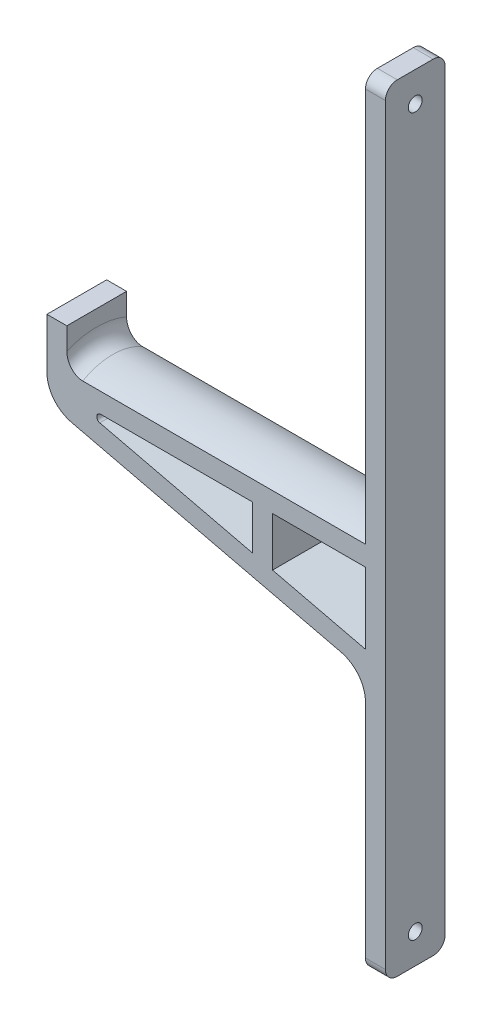
ISO-10303-21;
HEADER;
FILE_DESCRIPTION(('STEP AP214'),'2;1');
FILE_NAME('part.step','',(''),(''),'','','');
FILE_SCHEMA(('AUTOMOTIVE_DESIGN { 1 0 10303 214 1 1 1 1 }'));
ENDSEC;
DATA;
#1=APPLICATION_CONTEXT('core data for automotive mechanical design processes');
#2=APPLICATION_PROTOCOL_DEFINITION('international standard','automotive_design',2000,#1);
#3=PRODUCT_CONTEXT('',#1,'mechanical');
#4=PRODUCT('Part','Part','',(#3));
#5=PRODUCT_RELATED_PRODUCT_CATEGORY('part','',(#4));
#6=PRODUCT_DEFINITION_FORMATION('','',#4);
#7=PRODUCT_DEFINITION_CONTEXT('part definition',#1,'design');
#8=PRODUCT_DEFINITION('design','',#6,#7);
#9=PRODUCT_DEFINITION_SHAPE('','',#8);
#10=(LENGTH_UNIT() NAMED_UNIT(*) SI_UNIT(.MILLI.,.METRE.));
#11=(NAMED_UNIT(*) PLANE_ANGLE_UNIT() SI_UNIT($,.RADIAN.));
#12=(NAMED_UNIT(*) SI_UNIT($,.STERADIAN.) SOLID_ANGLE_UNIT());
#13=UNCERTAINTY_MEASURE_WITH_UNIT(LENGTH_MEASURE(1.E-05),#10,'distance_accuracy_value','');
#14=(GEOMETRIC_REPRESENTATION_CONTEXT(3) GLOBAL_UNCERTAINTY_ASSIGNED_CONTEXT((#13)) GLOBAL_UNIT_ASSIGNED_CONTEXT((#10,
#11,#12)) REPRESENTATION_CONTEXT('',''));
#15=CARTESIAN_POINT('',(0.,0.,0.));
#16=DIRECTION('',(0.,0.,1.));
#17=DIRECTION('',(1.,0.,0.));
#18=AXIS2_PLACEMENT_3D('',#15,#16,#17);
#19=CARTESIAN_POINT('',(0.,0.,-7.5));
#20=DIRECTION('',(0.,0.,-1.));
#21=DIRECTION('',(-1.,0.,0.));
#22=AXIS2_PLACEMENT_3D('',#19,#20,#21);
#23=PLANE('',#22);
#24=DIRECTION('',(0.972797328211724,-0.231657847318262,0.));
#25=VECTOR('',#24,1.);
#26=CARTESIAN_POINT('',(-25.8333333333333,-21.8036817957886,-7.5));
#27=LINE('',#26,#25);
#28=CARTESIAN_POINT('',(-25.8333333333333,-21.8036817957886,-7.5));
#29=VERTEX_POINT('',#28);
#30=CARTESIAN_POINT('',(-2.49999999999999,-27.3601832519512,-7.5));
#31=VERTEX_POINT('',#30);
#32=EDGE_CURVE('E266',#29,#31,#27,.T.);
#33=ORIENTED_EDGE('',*,*,#32,.T.);
#34=DIRECTION('',(0.,1.,0.));
#35=VECTOR('',#34,1.);
#36=CARTESIAN_POINT('',(-2.49999999999999,-9.50000000000023,-7.5));
#37=LINE('',#36,#35);
#38=CARTESIAN_POINT('',(-2.49999999999999,-9.50000000000023,-7.5));
#39=VERTEX_POINT('',#38);
#40=EDGE_CURVE('E262',#31,#39,#37,.T.);
#41=ORIENTED_EDGE('',*,*,#40,.T.);
#42=DIRECTION('',(-1.,0.,0.));
#43=VECTOR('',#42,1.);
#44=CARTESIAN_POINT('',(-2.49999999999999,-9.50000000000023,-7.5));
#45=LINE('',#44,#43);
#46=CARTESIAN_POINT('',(-25.8333333333333,-9.50000000000023,-7.5));
#47=VERTEX_POINT('',#46);
#48=EDGE_CURVE('E276',#39,#47,#45,.T.);
#49=ORIENTED_EDGE('',*,*,#48,.T.);
#50=DIRECTION('',(0.,-1.,0.));
#51=VECTOR('',#50,1.);
#52=CARTESIAN_POINT('',(-25.8333333333333,-9.50000000000023,-7.5));
#53=LINE('',#52,#51);
#54=EDGE_CURVE('E279',#47,#29,#53,.T.);
#55=ORIENTED_EDGE('',*,*,#54,.T.);
#56=EDGE_LOOP('',(#33,#41,#49,#55));
#57=FACE_BOUND('',#56,.T.);
#58=DIRECTION('',(0.,1.,0.));
#59=VECTOR('',#58,1.);
#60=CARTESIAN_POINT('',(-30.8333333333333,-9.50000000000023,-7.5));
#61=LINE('',#60,#59);
#62=CARTESIAN_POINT('',(-30.8333333333333,-20.6130029123253,-7.5));
#63=VERTEX_POINT('',#62);
#64=CARTESIAN_POINT('',(-30.8333333333333,-9.50000000000023,-7.5));
#65=VERTEX_POINT('',#64);
#66=EDGE_CURVE('E245',#63,#65,#61,.T.);
#67=ORIENTED_EDGE('',*,*,#66,.T.);
#68=DIRECTION('',(-1.,0.,0.));
#69=VECTOR('',#68,1.);
#70=CARTESIAN_POINT('',(-30.8333333333333,-9.50000000000023,-7.5));
#71=LINE('',#70,#69);
#72=CARTESIAN_POINT('',(-68.9840038831,-9.50000000000023,-7.5));
#73=VERTEX_POINT('',#72);
#74=EDGE_CURVE('E250',#65,#73,#71,.T.);
#75=ORIENTED_EDGE('',*,*,#74,.T.);
#76=CARTESIAN_POINT('',(-68.9840038831,-10.5000000000002,-7.5));
#77=DIRECTION('',(0.,0.,-1.));
#78=DIRECTION('',(-1.,0.,0.));
#79=AXIS2_PLACEMENT_3D('',#76,#77,#78);
#80=CIRCLE('',#79,1.);
#81=CARTESIAN_POINT('',(-69.2156617304183,-11.472797328212,-7.5));
#82=VERTEX_POINT('',#81);
#83=EDGE_CURVE('E348',#73,#82,#80,.F.);
#84=ORIENTED_EDGE('',*,*,#83,.T.);
#85=DIRECTION('',(0.972797328211724,-0.231657847318262,0.));
#86=VECTOR('',#85,1.);
#87=CARTESIAN_POINT('',(-77.5,-9.50000000000023,-7.5));
#88=LINE('',#87,#86);
#89=EDGE_CURVE('E253',#82,#63,#88,.T.);
#90=ORIENTED_EDGE('',*,*,#89,.T.);
#91=EDGE_LOOP('',(#67,#75,#84,#90));
#92=FACE_BOUND('',#91,.T.);
#93=DIRECTION('',(0.972797328211724,-0.231657847318262,0.));
#94=VECTOR('',#93,1.);
#95=CARTESIAN_POINT('',(-82.5,-13.4491378645859,-7.5));
#96=LINE('',#95,#94);
#97=CARTESIAN_POINT('',(-76.3532627785461,-14.9128959069426,-7.5));
#98=VERTEX_POINT('',#97);
#99=CARTESIAN_POINT('',(-8.64673722145387,-31.0362419576435,-7.5));
#100=VERTEX_POINT('',#99);
#101=EDGE_CURVE('E297',#98,#100,#96,.T.);
#102=ORIENTED_EDGE('',*,*,#101,.F.);
#103=CARTESIAN_POINT('',(-74.5,-7.13051728124883,-7.5));
#104=DIRECTION('',(0.,0.,-1.));
#105=DIRECTION('',(-1.,0.,0.));
#106=AXIS2_PLACEMENT_3D('',#103,#104,#105);
#107=CIRCLE('',#106,8.);
#108=CARTESIAN_POINT('',(-82.5,-7.13051728124883,-7.5));
#109=VERTEX_POINT('',#108);
#110=EDGE_CURVE('E397',#98,#109,#107,.T.);
#111=ORIENTED_EDGE('',*,*,#110,.T.);
#112=DIRECTION('',(0.,-1.,0.));
#113=VECTOR('',#112,1.);
#114=CARTESIAN_POINT('',(-82.5,-2.50000000000023,-7.5));
#115=LINE('',#114,#113);
#116=CARTESIAN_POINT('',(-82.5,5.49999999999977,-7.5));
#117=VERTEX_POINT('',#116);
#118=EDGE_CURVE('E320',#117,#109,#115,.T.);
#119=ORIENTED_EDGE('',*,*,#118,.F.);
#120=DIRECTION('',(-1.,0.,0.));
#121=VECTOR('',#120,1.);
#122=CARTESIAN_POINT('',(-82.5,5.49999999999977,-7.5));
#123=LINE('',#122,#121);
#124=CARTESIAN_POINT('',(-77.5,5.49999999999977,-7.5));
#125=VERTEX_POINT('',#124);
#126=EDGE_CURVE('E317',#125,#117,#123,.T.);
#127=ORIENTED_EDGE('',*,*,#126,.F.);
#128=DIRECTION('',(0.,1.,0.));
#129=VECTOR('',#128,1.);
#130=CARTESIAN_POINT('',(-77.5,5.49999999999977,-7.5));
#131=LINE('',#130,#129);
#132=CARTESIAN_POINT('',(-77.5,-0.0429097499041395,-7.5));
#133=VERTEX_POINT('',#132);
#134=EDGE_CURVE('E214',#133,#125,#131,.T.);
#135=ORIENTED_EDGE('',*,*,#134,.F.);
#136=CARTESIAN_POINT('',(-77.5,-0.0429097499041395,-7.5));
#137=CARTESIAN_POINT('',(-77.4999943278296,-0.177576007741638,-7.5));
#138=CARTESIAN_POINT('',(-77.4942567579362,-0.312170617133637,-7.5));
#139=CARTESIAN_POINT('',(-77.4714571774881,-0.580387440129107,-7.5));
#140=CARTESIAN_POINT('',(-77.4543960671081,-0.714009730174388,-7.5));
#141=CARTESIAN_POINT('',(-77.3864383600186,-1.11218740637753,-7.5));
#142=CARTESIAN_POINT('',(-77.3187673456991,-1.37407357490827,-7.5));
#143=CARTESIAN_POINT('',(-77.1405101950438,-1.88279924682887,-7.5));
#144=CARTESIAN_POINT('',(-77.0299099806489,-2.12963378347929,-7.5));
#145=CARTESIAN_POINT('',(-76.7680235940208,-2.60072869901935,-7.5));
#146=CARTESIAN_POINT('',(-76.6167450360818,-2.82499329183318,-7.5));
#147=CARTESIAN_POINT('',(-76.2799456207872,-3.23812254995176,-7.5));
#148=CARTESIAN_POINT('',(-76.0952829019245,-3.42767700108632,-7.5));
#149=CARTESIAN_POINT('',(-75.7942774575194,-3.68332580185535,-7.5));
#150=CARTESIAN_POINT('',(-75.689891213825,-3.76378952552315,-7.5));
#151=CARTESIAN_POINT('',(-75.4736963758054,-3.91410333542681,-7.5));
#152=CARTESIAN_POINT('',(-75.3618891519401,-3.98395537356905,-7.5));
#153=CARTESIAN_POINT('',(-75.1437055747614,-4.10522242872723,-7.5));
#154=CARTESIAN_POINT('',(-75.0379732827492,-4.15779928085335,-7.5));
#155=CARTESIAN_POINT('',(-74.822013127348,-4.25271230295014,-7.5));
#156=CARTESIAN_POINT('',(-74.711786161649,-4.29505050622147,-7.5));
#157=CARTESIAN_POINT('',(-74.4879927879373,-4.36869923189569,-7.5));
#158=CARTESIAN_POINT('',(-74.3744348835603,-4.40003556803171,-7.5));
#159=CARTESIAN_POINT('',(-74.1448197073769,-4.45123257213781,-7.5));
#160=CARTESIAN_POINT('',(-74.0287642871638,-4.47110145706736,-7.5));
#161=CARTESIAN_POINT('',(-73.8436349784915,-4.49323104654967,-7.5));
#162=CARTESIAN_POINT('',(-73.7750041598282,-4.49937613719018,-7.5));
#163=CARTESIAN_POINT('',(-73.6375860963478,-4.50756895060664,-7.5));
#164=CARTESIAN_POINT('',(-73.5687991611116,-4.50962186990795,-7.5));
#165=CARTESIAN_POINT('',(-73.5,-4.5096189432335,-7.5));
#166=B_SPLINE_CURVE_WITH_KNOTS('',3,(#136,#137,#138,#139,#140,#141,#142,#143,#144,#145,#146,
#147,#148,#149,#150,#151,#152,#153,#154,#155,#156,#157,#158,#159,#160,#161,#162,#163,#164,#165),
.UNSPECIFIED.,.F.,.F.,(4,2,2,2,2,2,2,2,2,2,2,2,2,2,4),(0.,0.403738744910341,0.807445398102464,
1.6147995331968,2.42241865331418,3.22988670597056,4.0189685637813,4.41384341880906,
4.80864555264576,5.16239790284064,5.51607994330327,5.86892650324208,6.22151991739111,
6.42812537877731,6.63446831053421),.UNSPECIFIED.);
#167=CARTESIAN_POINT('',(-73.5,-4.50961894323365,-7.5));
#168=VERTEX_POINT('',#167);
#169=EDGE_CURVE('E11',#133,#168,#166,.T.);
#170=ORIENTED_EDGE('',*,*,#169,.T.);
#171=DIRECTION('',(-1.,0.,0.));
#172=VECTOR('',#171,1.);
#173=CARTESIAN_POINT('',(-2.49999999999999,-4.50961894323356,-7.5));
#174=LINE('',#173,#172);
#175=CARTESIAN_POINT('',(-2.49999999999999,-4.50961894323356,-7.5));
#176=VERTEX_POINT('',#175);
#177=EDGE_CURVE('E222',#176,#168,#174,.T.);
#178=ORIENTED_EDGE('',*,*,#177,.F.);
#179=DIRECTION('',(0.,-1.,0.));
#180=VECTOR('',#179,1.);
#181=CARTESIAN_POINT('',(-2.49999999999999,97.4999999999998,-7.5));
#182=LINE('',#181,#180);
#183=CARTESIAN_POINT('',(-2.49999999999999,94.4999999999998,-7.5));
#184=VERTEX_POINT('',#183);
#185=EDGE_CURVE('E204',#184,#176,#182,.T.);
#186=ORIENTED_EDGE('',*,*,#185,.F.);
#187=DIRECTION('',(-1.,0.,0.));
#188=VECTOR('',#187,1.);
#189=CARTESIAN_POINT('',(2.49999999999998,94.4999999999998,-7.5));
#190=LINE('',#189,#188);
#191=CARTESIAN_POINT('',(2.49999999999998,94.4999999999998,-7.5));
#192=VERTEX_POINT('',#191);
#193=EDGE_CURVE('E365',#184,#192,#190,.F.);
#194=ORIENTED_EDGE('',*,*,#193,.T.);
#195=DIRECTION('',(0.,1.,0.));
#196=VECTOR('',#195,1.);
#197=CARTESIAN_POINT('',(2.49999999999998,97.4999999999998,-7.5));
#198=LINE('',#197,#196);
#199=CARTESIAN_POINT('',(2.50000000000001,-94.5000000000002,-7.5));
#200=VERTEX_POINT('',#199);
#201=EDGE_CURVE('E215',#200,#192,#198,.T.);
#202=ORIENTED_EDGE('',*,*,#201,.F.);
#203=DIRECTION('',(1.,0.,0.));
#204=VECTOR('',#203,1.);
#205=CARTESIAN_POINT('',(-2.49999999999998,-94.5000000000002,-7.5));
#206=LINE('',#205,#204);
#207=CARTESIAN_POINT('',(-2.49999999999999,-94.5000000000002,-7.5));
#208=VERTEX_POINT('',#207);
#209=EDGE_CURVE('E367',#200,#208,#206,.F.);
#210=ORIENTED_EDGE('',*,*,#209,.T.);
#211=DIRECTION('',(0.,-1.,0.));
#212=VECTOR('',#211,1.);
#213=CARTESIAN_POINT('',(-2.49999999999999,-32.5000000000002,-7.5));
#214=LINE('',#213,#212);
#215=CARTESIAN_POINT('',(-2.49999999999999,-38.8186205833373,-7.5));
#216=VERTEX_POINT('',#215);
#217=EDGE_CURVE('E293',#216,#208,#214,.T.);
#218=ORIENTED_EDGE('',*,*,#217,.F.);
#219=CARTESIAN_POINT('',(-10.5,-38.8186205833373,-7.5));
#220=DIRECTION('',(0.,0.,-1.));
#221=DIRECTION('',(-1.,0.,0.));
#222=AXIS2_PLACEMENT_3D('',#219,#220,#221);
#223=CIRCLE('',#222,8.);
#224=EDGE_CURVE('E403',#216,#100,#223,.F.);
#225=ORIENTED_EDGE('',*,*,#224,.T.);
#226=EDGE_LOOP('',(#102,#111,#119,#127,#135,#170,#178,#186,#194,#202,#210,#218,#225));
#227=FACE_BOUND('',#226,.T.);
#228=ADVANCED_FACE('F33',(#57,#92,#227),#23,.T.);
#229=CARTESIAN_POINT('',(0.,0.,7.5));
#230=DIRECTION('',(0.,0.,-1.));
#231=DIRECTION('',(-1.,0.,0.));
#232=AXIS2_PLACEMENT_3D('',#229,#230,#231);
#233=PLANE('',#232);
#234=DIRECTION('',(-1.,0.,0.));
#235=VECTOR('',#234,1.);
#236=CARTESIAN_POINT('',(-30.8333333333333,-9.50000000000023,7.5));
#237=LINE('',#236,#235);
#238=CARTESIAN_POINT('',(-30.8333333333333,-9.50000000000023,7.5));
#239=VERTEX_POINT('',#238);
#240=CARTESIAN_POINT('',(-68.9840038831,-9.50000000000023,7.5));
#241=VERTEX_POINT('',#240);
#242=EDGE_CURVE('E241',#239,#241,#237,.T.);
#243=ORIENTED_EDGE('',*,*,#242,.F.);
#244=DIRECTION('',(0.,1.,0.));
#245=VECTOR('',#244,1.);
#246=CARTESIAN_POINT('',(-30.8333333333333,-9.50000000000023,7.5));
#247=LINE('',#246,#245);
#248=CARTESIAN_POINT('',(-30.8333333333333,-20.6130029123253,7.5));
#249=VERTEX_POINT('',#248);
#250=EDGE_CURVE('E247',#249,#239,#247,.T.);
#251=ORIENTED_EDGE('',*,*,#250,.F.);
#252=DIRECTION('',(0.972797328211724,-0.231657847318262,0.));
#253=VECTOR('',#252,1.);
#254=CARTESIAN_POINT('',(-77.5,-9.50000000000023,7.5));
#255=LINE('',#254,#253);
#256=CARTESIAN_POINT('',(-69.2156617304183,-11.472797328212,7.5));
#257=VERTEX_POINT('',#256);
#258=EDGE_CURVE('E244',#257,#249,#255,.T.);
#259=ORIENTED_EDGE('',*,*,#258,.F.);
#260=CARTESIAN_POINT('',(-68.9840038831,-10.5000000000002,7.5));
#261=DIRECTION('',(0.,0.,-1.));
#262=DIRECTION('',(-1.,0.,0.));
#263=AXIS2_PLACEMENT_3D('',#260,#261,#262);
#264=CIRCLE('',#263,1.);
#265=EDGE_CURVE('E350',#257,#241,#264,.T.);
#266=ORIENTED_EDGE('',*,*,#265,.T.);
#267=EDGE_LOOP('',(#243,#251,#259,#266));
#268=FACE_BOUND('',#267,.T.);
#269=DIRECTION('',(0.,1.,0.));
#270=VECTOR('',#269,1.);
#271=CARTESIAN_POINT('',(-2.49999999999999,-9.50000000000023,7.5));
#272=LINE('',#271,#270);
#273=CARTESIAN_POINT('',(-2.49999999999999,-27.3601832519512,7.5));
#274=VERTEX_POINT('',#273);
#275=CARTESIAN_POINT('',(-2.49999999999999,-9.50000000000023,7.5));
#276=VERTEX_POINT('',#275);
#277=EDGE_CURVE('E263',#274,#276,#272,.T.);
#278=ORIENTED_EDGE('',*,*,#277,.F.);
#279=DIRECTION('',(0.972797328211724,-0.231657847318262,0.));
#280=VECTOR('',#279,1.);
#281=CARTESIAN_POINT('',(-25.8333333333333,-21.8036817957886,7.5));
#282=LINE('',#281,#280);
#283=CARTESIAN_POINT('',(-25.8333333333333,-21.8036817957886,7.5));
#284=VERTEX_POINT('',#283);
#285=EDGE_CURVE('E271',#284,#274,#282,.T.);
#286=ORIENTED_EDGE('',*,*,#285,.F.);
#287=DIRECTION('',(0.,-1.,0.));
#288=VECTOR('',#287,1.);
#289=CARTESIAN_POINT('',(-25.8333333333333,-9.50000000000023,7.5));
#290=LINE('',#289,#288);
#291=CARTESIAN_POINT('',(-25.8333333333333,-9.50000000000023,7.5));
#292=VERTEX_POINT('',#291);
#293=EDGE_CURVE('E268',#292,#284,#290,.T.);
#294=ORIENTED_EDGE('',*,*,#293,.F.);
#295=DIRECTION('',(-1.,0.,0.));
#296=VECTOR('',#295,1.);
#297=CARTESIAN_POINT('',(-2.49999999999999,-9.50000000000023,7.5));
#298=LINE('',#297,#296);
#299=EDGE_CURVE('E265',#276,#292,#298,.T.);
#300=ORIENTED_EDGE('',*,*,#299,.F.);
#301=EDGE_LOOP('',(#278,#286,#294,#300));
#302=FACE_BOUND('',#301,.T.);
#303=DIRECTION('',(0.,-1.,0.));
#304=VECTOR('',#303,1.);
#305=CARTESIAN_POINT('',(-82.5,-2.50000000000023,7.5));
#306=LINE('',#305,#304);
#307=CARTESIAN_POINT('',(-82.5,5.49999999999977,7.5));
#308=VERTEX_POINT('',#307);
#309=CARTESIAN_POINT('',(-82.5,-7.13051728124883,7.5));
#310=VERTEX_POINT('',#309);
#311=EDGE_CURVE('E306',#308,#310,#306,.T.);
#312=ORIENTED_EDGE('',*,*,#311,.T.);
#313=CARTESIAN_POINT('',(-74.5,-7.13051728124883,7.5));
#314=DIRECTION('',(0.,0.,-1.));
#315=DIRECTION('',(-1.,0.,0.));
#316=AXIS2_PLACEMENT_3D('',#313,#314,#315);
#317=CIRCLE('',#316,8.);
#318=CARTESIAN_POINT('',(-76.3532627785461,-14.9128959069426,7.5));
#319=VERTEX_POINT('',#318);
#320=EDGE_CURVE('E401',#310,#319,#317,.F.);
#321=ORIENTED_EDGE('',*,*,#320,.T.);
#322=DIRECTION('',(0.972797328211724,-0.231657847318262,0.));
#323=VECTOR('',#322,1.);
#324=CARTESIAN_POINT('',(-82.5,-13.4491378645859,7.5));
#325=LINE('',#324,#323);
#326=CARTESIAN_POINT('',(-8.64673722145387,-31.0362419576435,7.5));
#327=VERTEX_POINT('',#326);
#328=EDGE_CURVE('E309',#319,#327,#325,.T.);
#329=ORIENTED_EDGE('',*,*,#328,.T.);
#330=CARTESIAN_POINT('',(-10.5,-38.8186205833373,7.5));
#331=DIRECTION('',(0.,0.,-1.));
#332=DIRECTION('',(-1.,0.,0.));
#333=AXIS2_PLACEMENT_3D('',#330,#331,#332);
#334=CIRCLE('',#333,8.);
#335=CARTESIAN_POINT('',(-2.49999999999999,-38.8186205833373,7.5));
#336=VERTEX_POINT('',#335);
#337=EDGE_CURVE('E405',#327,#336,#334,.T.);
#338=ORIENTED_EDGE('',*,*,#337,.T.);
#339=DIRECTION('',(0.,-1.,0.));
#340=VECTOR('',#339,1.);
#341=CARTESIAN_POINT('',(-2.49999999999999,-32.5000000000002,7.5));
#342=LINE('',#341,#340);
#343=CARTESIAN_POINT('',(-2.49999999999999,-94.5000000000002,7.5));
#344=VERTEX_POINT('',#343);
#345=EDGE_CURVE('E294',#336,#344,#342,.T.);
#346=ORIENTED_EDGE('',*,*,#345,.T.);
#347=DIRECTION('',(1.,0.,0.));
#348=VECTOR('',#347,1.);
#349=CARTESIAN_POINT('',(-2.62290189567694E-13,-94.5000000000002,7.5));
#350=LINE('',#349,#348);
#351=CARTESIAN_POINT('',(2.50000000000001,-94.5000000000002,7.5));
#352=VERTEX_POINT('',#351);
#353=EDGE_CURVE('E378',#344,#352,#350,.T.);
#354=ORIENTED_EDGE('',*,*,#353,.T.);
#355=DIRECTION('',(0.,1.,0.));
#356=VECTOR('',#355,1.);
#357=CARTESIAN_POINT('',(2.49999999999998,97.4999999999998,7.5));
#358=LINE('',#357,#356);
#359=CARTESIAN_POINT('',(2.49999999999998,94.4999999999998,7.5));
#360=VERTEX_POINT('',#359);
#361=EDGE_CURVE('E296',#352,#360,#358,.T.);
#362=ORIENTED_EDGE('',*,*,#361,.T.);
#363=DIRECTION('',(-1.,0.,0.));
#364=VECTOR('',#363,1.);
#365=CARTESIAN_POINT('',(0.,94.4999999999998,7.5));
#366=LINE('',#365,#364);
#367=CARTESIAN_POINT('',(-2.49999999999999,94.4999999999998,7.5));
#368=VERTEX_POINT('',#367);
#369=EDGE_CURVE('E375',#360,#368,#366,.T.);
#370=ORIENTED_EDGE('',*,*,#369,.T.);
#371=DIRECTION('',(0.,-1.,0.));
#372=VECTOR('',#371,1.);
#373=CARTESIAN_POINT('',(-2.49999999999999,97.4999999999998,7.5));
#374=LINE('',#373,#372);
#375=CARTESIAN_POINT('',(-2.49999999999999,-4.50961894323356,7.5));
#376=VERTEX_POINT('',#375);
#377=EDGE_CURVE('E300',#368,#376,#374,.T.);
#378=ORIENTED_EDGE('',*,*,#377,.T.);
#379=DIRECTION('',(-1.,0.,0.));
#380=VECTOR('',#379,1.);
#381=CARTESIAN_POINT('',(-2.49999999999999,-4.50961894323356,7.5));
#382=LINE('',#381,#380);
#383=CARTESIAN_POINT('',(-73.5,-4.50961894323365,7.5));
#384=VERTEX_POINT('',#383);
#385=EDGE_CURVE('E224',#376,#384,#382,.T.);
#386=ORIENTED_EDGE('',*,*,#385,.T.);
#387=CARTESIAN_POINT('',(-73.5,-4.50961894323365,7.5));
#388=CARTESIAN_POINT('',(-73.6025902841742,-4.50964194067649,7.5));
#389=CARTESIAN_POINT('',(-73.705168855258,-4.50506222004552,7.5));
#390=CARTESIAN_POINT('',(-73.9094819642661,-4.48687384495579,7.5));
#391=CARTESIAN_POINT('',(-74.0112168275597,-4.47326885225382,7.5));
#392=CARTESIAN_POINT('',(-74.2126304368516,-4.43729118673338,7.5));
#393=CARTESIAN_POINT('',(-74.3123166155492,-4.41496015433474,7.5));
#394=CARTESIAN_POINT('',(-74.5093949999515,-4.36186880041758,7.5));
#395=CARTESIAN_POINT('',(-74.6067870642351,-4.33110796071123,7.5));
#396=CARTESIAN_POINT('',(-74.8942880348611,-4.2268423138986,7.5));
#397=CARTESIAN_POINT('',(-75.0801569948872,-4.14127453521057,7.5));
#398=CARTESIAN_POINT('',(-75.4360850885891,-3.94193612391229,7.5));
#399=CARTESIAN_POINT('',(-75.6061274801784,-3.82813608189059,7.5));
#400=CARTESIAN_POINT('',(-75.9372985743054,-3.56887198672956,7.5));
#401=CARTESIAN_POINT('',(-76.0972393836512,-3.42189305826567,7.5));
#402=CARTESIAN_POINT('',(-76.3935162839421,-3.1058851093121,7.5));
#403=CARTESIAN_POINT('',(-76.5298447836372,-2.93684902805951,7.5));
#404=CARTESIAN_POINT('',(-76.7926131932549,-2.55901054046197,7.5));
#405=CARTESIAN_POINT('',(-76.9157070938166,-2.34787742140564,7.5));
#406=CARTESIAN_POINT('',(-77.1280149728192,-1.9092097242284,7.5));
#407=CARTESIAN_POINT('',(-77.2172145408469,-1.68166821877259,7.5));
#408=CARTESIAN_POINT('',(-77.3584618263944,-1.22119472619909,7.5));
#409=CARTESIAN_POINT('',(-77.4113454360963,-0.988521009036571,7.5));
#410=CARTESIAN_POINT('',(-77.4644187284333,-0.635832400448668,7.5));
#411=CARTESIAN_POINT('',(-77.4777344648064,-0.517661139420514,7.5));
#412=CARTESIAN_POINT('',(-77.4955236814429,-0.280646083601293,7.5));
#413=CARTESIAN_POINT('',(-77.4999964555074,-0.161802235857444,7.5));
#414=CARTESIAN_POINT('',(-77.5,-0.0429097499041383,7.5));
#415=B_SPLINE_CURVE_WITH_KNOTS('',3,(#387,#388,#389,#390,#391,#392,#393,#394,#395,#396,#397,
#398,#399,#400,#401,#402,#403,#404,#405,#406,#407,#408,#409,#410,#411,#412,#413,#414),
.UNSPECIFIED.,.F.,.F.,(4,2,2,2,2,2,2,2,2,2,2,2,2,4),(0.,0.307649212921259,0.615173681883504,
0.921248229928997,1.22734159687376,1.83821761017508,2.44973266185369,3.09878528897598,
3.74804619778951,4.47816606778644,5.2085960069707,5.9215927737994,6.27806374807996,
6.63456318898031),.UNSPECIFIED.);
#416=CARTESIAN_POINT('',(-77.5,-0.0429097499041395,7.5));
#417=VERTEX_POINT('',#416);
#418=EDGE_CURVE('E47',#384,#417,#415,.T.);
#419=ORIENTED_EDGE('',*,*,#418,.T.);
#420=DIRECTION('',(0.,1.,0.));
#421=VECTOR('',#420,1.);
#422=CARTESIAN_POINT('',(-77.5,5.49999999999977,7.5));
#423=LINE('',#422,#421);
#424=CARTESIAN_POINT('',(-77.5,5.49999999999977,7.5));
#425=VERTEX_POINT('',#424);
#426=EDGE_CURVE('E302',#417,#425,#423,.T.);
#427=ORIENTED_EDGE('',*,*,#426,.T.);
#428=DIRECTION('',(-1.,0.,0.));
#429=VECTOR('',#428,1.);
#430=CARTESIAN_POINT('',(-82.5,5.49999999999977,7.5));
#431=LINE('',#430,#429);
#432=EDGE_CURVE('E304',#425,#308,#431,.T.);
#433=ORIENTED_EDGE('',*,*,#432,.T.);
#434=EDGE_LOOP('',(#312,#321,#329,#338,#346,#354,#362,#370,#378,#386,#419,#427,#433));
#435=FACE_BOUND('',#434,.T.);
#436=ADVANCED_FACE('F414',(#268,#302,#435),#233,.F.);
#437=CARTESIAN_POINT('',(-2.49999999999999,-32.5000000000002,7.5));
#438=DIRECTION('',(1.,0.,0.));
#439=DIRECTION('',(0.,1.,0.));
#440=AXIS2_PLACEMENT_3D('',#437,#438,#439);
#441=PLANE('',#440);
#442=CARTESIAN_POINT('',(-2.49999999999999,-90.,0.));
#443=DIRECTION('',(-1.,0.,0.));
#444=DIRECTION('',(0.,-1.,0.));
#445=AXIS2_PLACEMENT_3D('',#442,#443,#444);
#446=CIRCLE('',#445,1.75);
#447=CARTESIAN_POINT('',(-2.49999999999999,-91.75,0.));
#448=VERTEX_POINT('',#447);
#449=EDGE_CURVE('E231',#448,#448,#446,.T.);
#450=ORIENTED_EDGE('',*,*,#449,.F.);
#451=EDGE_LOOP('',(#450));
#452=FACE_BOUND('',#451,.T.);
#453=ORIENTED_EDGE('',*,*,#345,.F.);
#454=DIRECTION('',(0.,0.,-1.));
#455=VECTOR('',#454,1.);
#456=CARTESIAN_POINT('',(-2.49999999999999,-38.8186205833373,-7.5));
#457=LINE('',#456,#455);
#458=EDGE_CURVE('E389',#336,#216,#457,.T.);
#459=ORIENTED_EDGE('',*,*,#458,.T.);
#460=ORIENTED_EDGE('',*,*,#217,.T.);
#461=CARTESIAN_POINT('',(-2.49999999999999,-94.5000000000002,-4.5));
#462=DIRECTION('',(1.,0.,0.));
#463=DIRECTION('',(0.,1.,0.));
#464=AXIS2_PLACEMENT_3D('',#461,#462,#463);
#465=CIRCLE('',#464,3.);
#466=CARTESIAN_POINT('',(-2.49999999999999,-97.5000000000002,-4.5));
#467=VERTEX_POINT('',#466);
#468=EDGE_CURVE('E373',#208,#467,#465,.F.);
#469=ORIENTED_EDGE('',*,*,#468,.T.);
#470=DIRECTION('',(0.,0.,-1.));
#471=VECTOR('',#470,1.);
#472=CARTESIAN_POINT('',(-2.49999999999999,-97.5000000000002,7.5));
#473=LINE('',#472,#471);
#474=CARTESIAN_POINT('',(-2.49999999999999,-97.5000000000002,4.5));
#475=VERTEX_POINT('',#474);
#476=EDGE_CURVE('E338',#475,#467,#473,.T.);
#477=ORIENTED_EDGE('',*,*,#476,.F.);
#478=CARTESIAN_POINT('',(-2.49999999999999,-94.5000000000002,4.5));
#479=DIRECTION('',(1.,0.,0.));
#480=DIRECTION('',(0.,1.,0.));
#481=AXIS2_PLACEMENT_3D('',#478,#479,#480);
#482=CIRCLE('',#481,3.);
#483=EDGE_CURVE('E370',#475,#344,#482,.F.);
#484=ORIENTED_EDGE('',*,*,#483,.T.);
#485=EDGE_LOOP('',(#453,#459,#460,#469,#477,#484));
#486=FACE_BOUND('',#485,.T.);
#487=ADVANCED_FACE('F418',(#452,#486),#441,.F.);
#488=CARTESIAN_POINT('',(2.50000000000001,-97.5000000000002,7.5));
#489=DIRECTION('',(0.,1.,0.));
#490=DIRECTION('',(-1.,0.,0.));
#491=AXIS2_PLACEMENT_3D('',#488,#489,#490);
#492=PLANE('',#491);
#493=ORIENTED_EDGE('',*,*,#476,.T.);
#494=DIRECTION('',(1.,0.,0.));
#495=VECTOR('',#494,1.);
#496=CARTESIAN_POINT('',(2.50000000000001,-97.5000000000002,-4.5));
#497=LINE('',#496,#495);
#498=CARTESIAN_POINT('',(2.50000000000001,-97.5000000000002,-4.5));
#499=VERTEX_POINT('',#498);
#500=EDGE_CURVE('E354',#467,#499,#497,.T.);
#501=ORIENTED_EDGE('',*,*,#500,.T.);
#502=DIRECTION('',(0.,0.,-1.));
#503=VECTOR('',#502,1.);
#504=CARTESIAN_POINT('',(2.50000000000001,-97.5000000000002,7.5));
#505=LINE('',#504,#503);
#506=CARTESIAN_POINT('',(2.50000000000001,-97.5000000000002,4.5));
#507=VERTEX_POINT('',#506);
#508=EDGE_CURVE('E335',#507,#499,#505,.T.);
#509=ORIENTED_EDGE('',*,*,#508,.F.);
#510=DIRECTION('',(1.,0.,0.));
#511=VECTOR('',#510,1.);
#512=CARTESIAN_POINT('',(2.50000000000001,-97.5000000000002,4.5));
#513=LINE('',#512,#511);
#514=EDGE_CURVE('E352',#507,#475,#513,.F.);
#515=ORIENTED_EDGE('',*,*,#514,.T.);
#516=EDGE_LOOP('',(#493,#501,#509,#515));
#517=FACE_BOUND('',#516,.T.);
#518=ADVANCED_FACE('F451',(#517),#492,.F.);
#519=CARTESIAN_POINT('',(2.49999999999998,97.4999999999998,7.5));
#520=DIRECTION('',(-1.,0.,0.));
#521=DIRECTION('',(0.,-1.,0.));
#522=AXIS2_PLACEMENT_3D('',#519,#520,#521);
#523=PLANE('',#522);
#524=CARTESIAN_POINT('',(2.49999999999998,90.,0.));
#525=DIRECTION('',(-1.,0.,0.));
#526=DIRECTION('',(0.,-1.,0.));
#527=AXIS2_PLACEMENT_3D('',#524,#525,#526);
#528=CIRCLE('',#527,1.75);
#529=CARTESIAN_POINT('',(2.49999999999998,88.25,0.));
#530=VERTEX_POINT('',#529);
#531=EDGE_CURVE('E235',#530,#530,#528,.T.);
#532=ORIENTED_EDGE('',*,*,#531,.T.);
#533=EDGE_LOOP('',(#532));
#534=FACE_BOUND('',#533,.T.);
#535=CARTESIAN_POINT('',(2.5,-90.,0.));
#536=DIRECTION('',(-1.,0.,0.));
#537=DIRECTION('',(0.,-1.,0.));
#538=AXIS2_PLACEMENT_3D('',#535,#536,#537);
#539=CIRCLE('',#538,1.75);
#540=CARTESIAN_POINT('',(2.50000000000001,-91.75,0.));
#541=VERTEX_POINT('',#540);
#542=EDGE_CURVE('E240',#541,#541,#539,.T.);
#543=ORIENTED_EDGE('',*,*,#542,.T.);
#544=EDGE_LOOP('',(#543));
#545=FACE_BOUND('',#544,.T.);
#546=ORIENTED_EDGE('',*,*,#508,.T.);
#547=CARTESIAN_POINT('',(2.50000000000001,-94.5000000000002,-4.5));
#548=DIRECTION('',(-1.,0.,0.));
#549=DIRECTION('',(0.,-1.,0.));
#550=AXIS2_PLACEMENT_3D('',#547,#548,#549);
#551=CIRCLE('',#550,3.);
#552=EDGE_CURVE('E363',#499,#200,#551,.F.);
#553=ORIENTED_EDGE('',*,*,#552,.T.);
#554=ORIENTED_EDGE('',*,*,#201,.T.);
#555=CARTESIAN_POINT('',(2.49999999999998,94.4999999999998,-4.5));
#556=DIRECTION('',(-1.,0.,0.));
#557=DIRECTION('',(0.,-1.,0.));
#558=AXIS2_PLACEMENT_3D('',#555,#556,#557);
#559=CIRCLE('',#558,3.);
#560=CARTESIAN_POINT('',(2.49999999999998,97.4999999999998,-4.5));
#561=VERTEX_POINT('',#560);
#562=EDGE_CURVE('E359',#192,#561,#559,.F.);
#563=ORIENTED_EDGE('',*,*,#562,.T.);
#564=DIRECTION('',(0.,0.,-1.));
#565=VECTOR('',#564,1.);
#566=CARTESIAN_POINT('',(2.49999999999998,97.4999999999998,7.5));
#567=LINE('',#566,#565);
#568=CARTESIAN_POINT('',(2.49999999999998,97.4999999999998,4.5));
#569=VERTEX_POINT('',#568);
#570=EDGE_CURVE('E332',#569,#561,#567,.T.);
#571=ORIENTED_EDGE('',*,*,#570,.F.);
#572=CARTESIAN_POINT('',(2.49999999999998,94.4999999999998,4.5));
#573=DIRECTION('',(-1.,0.,0.));
#574=DIRECTION('',(0.,-1.,0.));
#575=AXIS2_PLACEMENT_3D('',#572,#573,#574);
#576=CIRCLE('',#575,3.);
#577=EDGE_CURVE('E357',#569,#360,#576,.F.);
#578=ORIENTED_EDGE('',*,*,#577,.T.);
#579=ORIENTED_EDGE('',*,*,#361,.F.);
#580=CARTESIAN_POINT('',(2.50000000000001,-94.5000000000002,4.5));
#581=DIRECTION('',(-1.,0.,0.));
#582=DIRECTION('',(0.,-1.,0.));
#583=AXIS2_PLACEMENT_3D('',#580,#581,#582);
#584=CIRCLE('',#583,3.);
#585=EDGE_CURVE('E361',#352,#507,#584,.F.);
#586=ORIENTED_EDGE('',*,*,#585,.T.);
#587=EDGE_LOOP('',(#546,#553,#554,#563,#571,#578,#579,#586));
#588=FACE_BOUND('',#587,.T.);
#589=ADVANCED_FACE('F447',(#534,#545,#588),#523,.F.);
#590=CARTESIAN_POINT('',(2.49999999999998,97.4999999999998,7.5));
#591=DIRECTION('',(0.,-1.,0.));
#592=DIRECTION('',(0.,0.,-1.));
#593=AXIS2_PLACEMENT_3D('',#590,#591,#592);
#594=PLANE('',#593);
#595=ORIENTED_EDGE('',*,*,#570,.T.);
#596=DIRECTION('',(-1.,0.,0.));
#597=VECTOR('',#596,1.);
#598=CARTESIAN_POINT('',(-2.49999999999999,97.4999999999998,-4.5));
#599=LINE('',#598,#597);
#600=CARTESIAN_POINT('',(-2.49999999999999,97.4999999999998,-4.5));
#601=VERTEX_POINT('',#600);
#602=EDGE_CURVE('E383',#561,#601,#599,.T.);
#603=ORIENTED_EDGE('',*,*,#602,.T.);
#604=DIRECTION('',(0.,0.,-1.));
#605=VECTOR('',#604,1.);
#606=CARTESIAN_POINT('',(-2.49999999999999,97.4999999999998,7.5));
#607=LINE('',#606,#605);
#608=CARTESIAN_POINT('',(-2.49999999999999,97.4999999999998,4.5));
#609=VERTEX_POINT('',#608);
#610=EDGE_CURVE('E330',#609,#601,#607,.T.);
#611=ORIENTED_EDGE('',*,*,#610,.F.);
#612=DIRECTION('',(-1.,0.,0.));
#613=VECTOR('',#612,1.);
#614=CARTESIAN_POINT('',(2.49999999999998,97.4999999999998,4.5));
#615=LINE('',#614,#613);
#616=EDGE_CURVE('E381',#609,#569,#615,.F.);
#617=ORIENTED_EDGE('',*,*,#616,.T.);
#618=EDGE_LOOP('',(#595,#603,#611,#617));
#619=FACE_BOUND('',#618,.T.);
#620=ADVANCED_FACE('F443',(#619),#594,.F.);
#621=CARTESIAN_POINT('',(-2.49999999999999,97.4999999999998,7.5));
#622=DIRECTION('',(1.,0.,0.));
#623=DIRECTION('',(0.,1.,0.));
#624=AXIS2_PLACEMENT_3D('',#621,#622,#623);
#625=PLANE('',#624);
#626=CARTESIAN_POINT('',(-2.5,90.,0.));
#627=DIRECTION('',(-1.,0.,0.));
#628=DIRECTION('',(0.,-1.,0.));
#629=AXIS2_PLACEMENT_3D('',#626,#627,#628);
#630=CIRCLE('',#629,1.75);
#631=CARTESIAN_POINT('',(-2.5,88.25,0.));
#632=VERTEX_POINT('',#631);
#633=EDGE_CURVE('E232',#632,#632,#630,.T.);
#634=ORIENTED_EDGE('',*,*,#633,.F.);
#635=EDGE_LOOP('',(#634));
#636=FACE_BOUND('',#635,.T.);
#637=ORIENTED_EDGE('',*,*,#610,.T.);
#638=CARTESIAN_POINT('',(-2.49999999999999,94.4999999999998,-4.5));
#639=DIRECTION('',(1.,0.,0.));
#640=DIRECTION('',(0.,1.,0.));
#641=AXIS2_PLACEMENT_3D('',#638,#639,#640);
#642=CIRCLE('',#641,3.);
#643=EDGE_CURVE('E210',#601,#184,#642,.F.);
#644=ORIENTED_EDGE('',*,*,#643,.T.);
#645=ORIENTED_EDGE('',*,*,#185,.T.);
#646=CARTESIAN_POINT('',(-2.49999999999996,-17.5000000000001,0.));
#647=DIRECTION('',(-1.,0.,0.));
#648=DIRECTION('',(0.,-1.,0.));
#649=AXIS2_PLACEMENT_3D('',#646,#647,#648);
#650=CIRCLE('',#649,15.);
#651=EDGE_CURVE('E209',#176,#376,#650,.F.);
#652=ORIENTED_EDGE('',*,*,#651,.T.);
#653=ORIENTED_EDGE('',*,*,#377,.F.);
#654=CARTESIAN_POINT('',(-2.49999999999999,94.4999999999998,4.5));
#655=DIRECTION('',(1.,0.,0.));
#656=DIRECTION('',(0.,1.,0.));
#657=AXIS2_PLACEMENT_3D('',#654,#655,#656);
#658=CIRCLE('',#657,3.);
#659=EDGE_CURVE('E386',#368,#609,#658,.F.);
#660=ORIENTED_EDGE('',*,*,#659,.T.);
#661=EDGE_LOOP('',(#637,#644,#645,#652,#653,#660));
#662=FACE_BOUND('',#661,.T.);
#663=ADVANCED_FACE('F207',(#636,#662),#625,.F.);
#664=CARTESIAN_POINT('',(-77.5,5.49999999999977,7.5));
#665=DIRECTION('',(-1.,0.,0.));
#666=DIRECTION('',(0.,0.,1.));
#667=AXIS2_PLACEMENT_3D('',#664,#665,#666);
#668=PLANE('',#667);
#669=ORIENTED_EDGE('',*,*,#426,.F.);
#670=CARTESIAN_POINT('',(-77.5,-17.5000000000002,0.));
#671=DIRECTION('',(-1.,0.,0.));
#672=DIRECTION('',(0.,0.,1.));
#673=AXIS2_PLACEMENT_3D('',#670,#671,#672);
#674=CIRCLE('',#673,19.);
#675=EDGE_CURVE('E60',#417,#133,#674,.T.);
#676=ORIENTED_EDGE('',*,*,#675,.T.);
#677=ORIENTED_EDGE('',*,*,#134,.T.);
#678=DIRECTION('',(0.,0.,-1.));
#679=VECTOR('',#678,1.);
#680=CARTESIAN_POINT('',(-77.5,5.49999999999977,7.5));
#681=LINE('',#680,#679);
#682=EDGE_CURVE('E327',#425,#125,#681,.T.);
#683=ORIENTED_EDGE('',*,*,#682,.F.);
#684=EDGE_LOOP('',(#669,#676,#677,#683));
#685=FACE_BOUND('',#684,.T.);
#686=ADVANCED_FACE('F437',(#685),#668,.F.);
#687=CARTESIAN_POINT('',(-82.5,5.49999999999977,7.5));
#688=DIRECTION('',(0.,-1.,0.));
#689=DIRECTION('',(0.,0.,-1.));
#690=AXIS2_PLACEMENT_3D('',#687,#688,#689);
#691=PLANE('',#690);
#692=ORIENTED_EDGE('',*,*,#126,.T.);
#693=DIRECTION('',(0.,0.,-1.));
#694=VECTOR('',#693,1.);
#695=CARTESIAN_POINT('',(-82.5,5.49999999999977,7.5));
#696=LINE('',#695,#694);
#697=EDGE_CURVE('E312',#308,#117,#696,.T.);
#698=ORIENTED_EDGE('',*,*,#697,.F.);
#699=ORIENTED_EDGE('',*,*,#432,.F.);
#700=ORIENTED_EDGE('',*,*,#682,.T.);
#701=EDGE_LOOP('',(#692,#698,#699,#700));
#702=FACE_BOUND('',#701,.T.);
#703=ADVANCED_FACE('F433',(#702),#691,.F.);
#704=CARTESIAN_POINT('',(-82.5,-2.50000000000023,7.5));
#705=DIRECTION('',(1.,0.,0.));
#706=DIRECTION('',(0.,0.,-1.));
#707=AXIS2_PLACEMENT_3D('',#704,#705,#706);
#708=PLANE('',#707);
#709=ORIENTED_EDGE('',*,*,#118,.T.);
#710=DIRECTION('',(0.,0.,-1.));
#711=VECTOR('',#710,1.);
#712=CARTESIAN_POINT('',(-82.5,-7.13051728124883,7.5));
#713=LINE('',#712,#711);
#714=EDGE_CURVE('E399',#109,#310,#713,.F.);
#715=ORIENTED_EDGE('',*,*,#714,.T.);
#716=ORIENTED_EDGE('',*,*,#311,.F.);
#717=ORIENTED_EDGE('',*,*,#697,.T.);
#718=EDGE_LOOP('',(#709,#715,#716,#717));
#719=FACE_BOUND('',#718,.T.);
#720=ADVANCED_FACE('F429',(#719),#708,.F.);
#721=CARTESIAN_POINT('',(-82.5,-13.4491378645859,7.5));
#722=DIRECTION('',(0.231657847318262,0.972797328211724,0.));
#723=DIRECTION('',(-0.972797328211724,0.231657847318262,0.));
#724=AXIS2_PLACEMENT_3D('',#721,#722,#723);
#725=PLANE('',#724);
#726=ORIENTED_EDGE('',*,*,#101,.T.);
#727=DIRECTION('',(0.,0.,-1.));
#728=VECTOR('',#727,1.);
#729=CARTESIAN_POINT('',(-8.6467372214539,-31.0362419576435,7.5));
#730=LINE('',#729,#728);
#731=EDGE_CURVE('E395',#100,#327,#730,.F.);
#732=ORIENTED_EDGE('',*,*,#731,.T.);
#733=ORIENTED_EDGE('',*,*,#328,.F.);
#734=DIRECTION('',(0.,0.,-1.));
#735=VECTOR('',#734,1.);
#736=CARTESIAN_POINT('',(-76.3532627785461,-14.9128959069426,7.5));
#737=LINE('',#736,#735);
#738=EDGE_CURVE('E392',#319,#98,#737,.T.);
#739=ORIENTED_EDGE('',*,*,#738,.T.);
#740=EDGE_LOOP('',(#726,#732,#733,#739));
#741=FACE_BOUND('',#740,.T.);
#742=ADVANCED_FACE('F426',(#741),#725,.F.);
#743=CARTESIAN_POINT('',(-2.49999999999999,-9.50000000000023,7.5));
#744=DIRECTION('',(-1.,0.,0.));
#745=DIRECTION('',(0.,-1.,0.));
#746=AXIS2_PLACEMENT_3D('',#743,#744,#745);
#747=PLANE('',#746);
#748=ORIENTED_EDGE('',*,*,#40,.F.);
#749=DIRECTION('',(0.,0.,-1.));
#750=VECTOR('',#749,1.);
#751=CARTESIAN_POINT('',(-2.49999999999999,-27.3601832519512,7.5));
#752=LINE('',#751,#750);
#753=EDGE_CURVE('E273',#274,#31,#752,.T.);
#754=ORIENTED_EDGE('',*,*,#753,.F.);
#755=ORIENTED_EDGE('',*,*,#277,.T.);
#756=DIRECTION('',(0.,0.,-1.));
#757=VECTOR('',#756,1.);
#758=CARTESIAN_POINT('',(-2.49999999999999,-9.50000000000023,7.5));
#759=LINE('',#758,#757);
#760=EDGE_CURVE('E290',#276,#39,#759,.T.);
#761=ORIENTED_EDGE('',*,*,#760,.T.);
#762=EDGE_LOOP('',(#748,#754,#755,#761));
#763=FACE_BOUND('',#762,.T.);
#764=ADVANCED_FACE('F420',(#763),#747,.T.);
#765=CARTESIAN_POINT('',(-2.49999999999999,-9.50000000000023,7.5));
#766=DIRECTION('',(0.,-1.,0.));
#767=DIRECTION('',(0.,0.,-1.));
#768=AXIS2_PLACEMENT_3D('',#765,#766,#767);
#769=PLANE('',#768);
#770=ORIENTED_EDGE('',*,*,#48,.F.);
#771=ORIENTED_EDGE('',*,*,#760,.F.);
#772=ORIENTED_EDGE('',*,*,#299,.T.);
#773=DIRECTION('',(0.,0.,-1.));
#774=VECTOR('',#773,1.);
#775=CARTESIAN_POINT('',(-25.8333333333333,-9.50000000000023,7.5));
#776=LINE('',#775,#774);
#777=EDGE_CURVE('E288',#292,#47,#776,.T.);
#778=ORIENTED_EDGE('',*,*,#777,.T.);
#779=EDGE_LOOP('',(#770,#771,#772,#778));
#780=FACE_BOUND('',#779,.T.);
#781=ADVANCED_FACE('F708',(#780),#769,.T.);
#782=CARTESIAN_POINT('',(-25.8333333333333,-9.50000000000023,7.5));
#783=DIRECTION('',(1.,0.,0.));
#784=DIRECTION('',(0.,0.,-1.));
#785=AXIS2_PLACEMENT_3D('',#782,#783,#784);
#786=PLANE('',#785);
#787=ORIENTED_EDGE('',*,*,#54,.F.);
#788=ORIENTED_EDGE('',*,*,#777,.F.);
#789=ORIENTED_EDGE('',*,*,#293,.T.);
#790=DIRECTION('',(0.,0.,-1.));
#791=VECTOR('',#790,1.);
#792=CARTESIAN_POINT('',(-25.8333333333333,-21.8036817957886,7.5));
#793=LINE('',#792,#791);
#794=EDGE_CURVE('E286',#284,#29,#793,.T.);
#795=ORIENTED_EDGE('',*,*,#794,.T.);
#796=EDGE_LOOP('',(#787,#788,#789,#795));
#797=FACE_BOUND('',#796,.T.);
#798=ADVANCED_FACE('F698',(#797),#786,.T.);
#799=CARTESIAN_POINT('',(-25.8333333333333,-21.8036817957886,7.5));
#800=DIRECTION('',(0.231657847318262,0.972797328211724,0.));
#801=DIRECTION('',(-0.972797328211724,0.231657847318262,0.));
#802=AXIS2_PLACEMENT_3D('',#799,#800,#801);
#803=PLANE('',#802);
#804=ORIENTED_EDGE('',*,*,#32,.F.);
#805=ORIENTED_EDGE('',*,*,#794,.F.);
#806=ORIENTED_EDGE('',*,*,#285,.T.);
#807=ORIENTED_EDGE('',*,*,#753,.T.);
#808=EDGE_LOOP('',(#804,#805,#806,#807));
#809=FACE_BOUND('',#808,.T.);
#810=ADVANCED_FACE('F664',(#809),#803,.T.);
#811=CARTESIAN_POINT('',(-30.8333333333333,-9.50000000000023,7.5));
#812=DIRECTION('',(0.,-1.,0.));
#813=DIRECTION('',(0.,0.,-1.));
#814=AXIS2_PLACEMENT_3D('',#811,#812,#813);
#815=PLANE('',#814);
#816=ORIENTED_EDGE('',*,*,#242,.T.);
#817=DIRECTION('',(0.,0.,-1.));
#818=VECTOR('',#817,1.);
#819=CARTESIAN_POINT('',(-68.9840038831,-9.50000000000023,-7.5));
#820=LINE('',#819,#818);
#821=EDGE_CURVE('E341',#241,#73,#820,.T.);
#822=ORIENTED_EDGE('',*,*,#821,.T.);
#823=ORIENTED_EDGE('',*,*,#74,.F.);
#824=DIRECTION('',(0.,0.,-1.));
#825=VECTOR('',#824,1.);
#826=CARTESIAN_POINT('',(-30.8333333333333,-9.50000000000023,7.5));
#827=LINE('',#826,#825);
#828=EDGE_CURVE('E249',#239,#65,#827,.T.);
#829=ORIENTED_EDGE('',*,*,#828,.F.);
#830=EDGE_LOOP('',(#816,#822,#823,#829));
#831=FACE_BOUND('',#830,.T.);
#832=ADVANCED_FACE('F652',(#831),#815,.T.);
#833=CARTESIAN_POINT('',(-77.5,-9.50000000000023,7.5));
#834=DIRECTION('',(0.231657847318262,0.972797328211724,0.));
#835=DIRECTION('',(-0.972797328211724,0.231657847318262,0.));
#836=AXIS2_PLACEMENT_3D('',#833,#834,#835);
#837=PLANE('',#836);
#838=ORIENTED_EDGE('',*,*,#89,.F.);
#839=DIRECTION('',(0.,0.,-1.));
#840=VECTOR('',#839,1.);
#841=CARTESIAN_POINT('',(-69.2156617304183,-11.472797328212,7.5));
#842=LINE('',#841,#840);
#843=EDGE_CURVE('E346',#82,#257,#842,.F.);
#844=ORIENTED_EDGE('',*,*,#843,.T.);
#845=ORIENTED_EDGE('',*,*,#258,.T.);
#846=DIRECTION('',(0.,0.,-1.));
#847=VECTOR('',#846,1.);
#848=CARTESIAN_POINT('',(-30.8333333333333,-20.6130029123253,7.5));
#849=LINE('',#848,#847);
#850=EDGE_CURVE('E259',#249,#63,#849,.T.);
#851=ORIENTED_EDGE('',*,*,#850,.T.);
#852=EDGE_LOOP('',(#838,#844,#845,#851));
#853=FACE_BOUND('',#852,.T.);
#854=ADVANCED_FACE('F646',(#853),#837,.T.);
#855=CARTESIAN_POINT('',(-30.8333333333333,-9.50000000000023,7.5));
#856=DIRECTION('',(-1.,0.,0.));
#857=DIRECTION('',(0.,-1.,0.));
#858=AXIS2_PLACEMENT_3D('',#855,#856,#857);
#859=PLANE('',#858);
#860=ORIENTED_EDGE('',*,*,#66,.F.);
#861=ORIENTED_EDGE('',*,*,#850,.F.);
#862=ORIENTED_EDGE('',*,*,#250,.T.);
#863=ORIENTED_EDGE('',*,*,#828,.T.);
#864=EDGE_LOOP('',(#860,#861,#862,#863));
#865=FACE_BOUND('',#864,.T.);
#866=ADVANCED_FACE('F651',(#865),#859,.T.);
#867=CARTESIAN_POINT('',(7.5,90.,0.));
#868=DIRECTION('',(-1.,0.,0.));
#869=DIRECTION('',(0.,-1.,0.));
#870=AXIS2_PLACEMENT_3D('',#867,#868,#869);
#871=CYLINDRICAL_SURFACE('',#870,1.75);
#872=ORIENTED_EDGE('',*,*,#633,.T.);
#873=EDGE_LOOP('',(#872));
#874=FACE_BOUND('',#873,.T.);
#875=ORIENTED_EDGE('',*,*,#531,.F.);
#876=EDGE_LOOP('',(#875));
#877=FACE_BOUND('',#876,.T.);
#878=ADVANCED_FACE('F674',(#874,#877),#871,.F.);
#879=CARTESIAN_POINT('',(7.50000000000001,-90.,0.));
#880=DIRECTION('',(-1.,0.,0.));
#881=DIRECTION('',(0.,-1.,0.));
#882=AXIS2_PLACEMENT_3D('',#879,#880,#881);
#883=CYLINDRICAL_SURFACE('',#882,1.75);
#884=ORIENTED_EDGE('',*,*,#449,.T.);
#885=EDGE_LOOP('',(#884));
#886=FACE_BOUND('',#885,.T.);
#887=ORIENTED_EDGE('',*,*,#542,.F.);
#888=EDGE_LOOP('',(#887));
#889=FACE_BOUND('',#888,.T.);
#890=ADVANCED_FACE('F462',(#886,#889),#883,.F.);
#891=CARTESIAN_POINT('',(-68.9840038831,-10.5000000000002,7.5));
#892=DIRECTION('',(0.,0.,1.));
#893=DIRECTION('',(1.,0.,0.));
#894=AXIS2_PLACEMENT_3D('',#891,#892,#893);
#895=CYLINDRICAL_SURFACE('',#894,1.);
#896=ORIENTED_EDGE('',*,*,#265,.F.);
#897=ORIENTED_EDGE('',*,*,#843,.F.);
#898=ORIENTED_EDGE('',*,*,#83,.F.);
#899=ORIENTED_EDGE('',*,*,#821,.F.);
#900=EDGE_LOOP('',(#896,#897,#898,#899));
#901=FACE_BOUND('',#900,.T.);
#902=ADVANCED_FACE('F459',(#901),#895,.F.);
#903=CARTESIAN_POINT('',(-2.49999999999996,-17.5000000000001,0.));
#904=DIRECTION('',(-1.,0.,0.));
#905=DIRECTION('',(0.,-1.,0.));
#906=AXIS2_PLACEMENT_3D('',#903,#904,#905);
#907=CYLINDRICAL_SURFACE('',#906,15.);
#908=ORIENTED_EDGE('',*,*,#177,.T.);
#909=CARTESIAN_POINT('',(-73.5,-17.5000000000002,0.));
#910=DIRECTION('',(-1.,0.,0.));
#911=DIRECTION('',(0.,0.,1.));
#912=AXIS2_PLACEMENT_3D('',#909,#910,#911);
#913=CIRCLE('',#912,15.);
#914=EDGE_CURVE('E407',#168,#384,#913,.F.);
#915=ORIENTED_EDGE('',*,*,#914,.T.);
#916=ORIENTED_EDGE('',*,*,#385,.F.);
#917=ORIENTED_EDGE('',*,*,#651,.F.);
#918=EDGE_LOOP('',(#908,#915,#916,#917));
#919=FACE_BOUND('',#918,.T.);
#920=ADVANCED_FACE('F220',(#919),#907,.T.);
#921=CARTESIAN_POINT('',(2.50000000000001,-94.5000000000002,-4.5));
#922=DIRECTION('',(-1.,0.,0.));
#923=DIRECTION('',(0.,-1.,0.));
#924=AXIS2_PLACEMENT_3D('',#921,#922,#923);
#925=CYLINDRICAL_SURFACE('',#924,3.);
#926=ORIENTED_EDGE('',*,*,#468,.F.);
#927=ORIENTED_EDGE('',*,*,#209,.F.);
#928=ORIENTED_EDGE('',*,*,#552,.F.);
#929=ORIENTED_EDGE('',*,*,#500,.F.);
#930=EDGE_LOOP('',(#926,#927,#928,#929));
#931=FACE_BOUND('',#930,.T.);
#932=ADVANCED_FACE('F464',(#931),#925,.T.);
#933=CARTESIAN_POINT('',(-2.62290189567694E-13,-94.5000000000002,4.5));
#934=DIRECTION('',(1.,0.,0.));
#935=DIRECTION('',(0.,1.,0.));
#936=AXIS2_PLACEMENT_3D('',#933,#934,#935);
#937=CYLINDRICAL_SURFACE('',#936,3.);
#938=ORIENTED_EDGE('',*,*,#483,.F.);
#939=ORIENTED_EDGE('',*,*,#514,.F.);
#940=ORIENTED_EDGE('',*,*,#585,.F.);
#941=ORIENTED_EDGE('',*,*,#353,.F.);
#942=EDGE_LOOP('',(#938,#939,#940,#941));
#943=FACE_BOUND('',#942,.T.);
#944=ADVANCED_FACE('F467',(#943),#937,.T.);
#945=CARTESIAN_POINT('',(2.49999999999998,94.4999999999998,-4.5));
#946=DIRECTION('',(1.,0.,0.));
#947=DIRECTION('',(0.,0.,-1.));
#948=AXIS2_PLACEMENT_3D('',#945,#946,#947);
#949=CYLINDRICAL_SURFACE('',#948,3.);
#950=ORIENTED_EDGE('',*,*,#562,.F.);
#951=ORIENTED_EDGE('',*,*,#193,.F.);
#952=ORIENTED_EDGE('',*,*,#643,.F.);
#953=ORIENTED_EDGE('',*,*,#602,.F.);
#954=EDGE_LOOP('',(#950,#951,#952,#953));
#955=FACE_BOUND('',#954,.T.);
#956=ADVANCED_FACE('F471',(#955),#949,.T.);
#957=CARTESIAN_POINT('',(0.,94.4999999999998,4.5));
#958=DIRECTION('',(-1.,0.,0.));
#959=DIRECTION('',(0.,0.,1.));
#960=AXIS2_PLACEMENT_3D('',#957,#958,#959);
#961=CYLINDRICAL_SURFACE('',#960,3.);
#962=ORIENTED_EDGE('',*,*,#577,.F.);
#963=ORIENTED_EDGE('',*,*,#616,.F.);
#964=ORIENTED_EDGE('',*,*,#659,.F.);
#965=ORIENTED_EDGE('',*,*,#369,.F.);
#966=EDGE_LOOP('',(#962,#963,#964,#965));
#967=FACE_BOUND('',#966,.T.);
#968=ADVANCED_FACE('F475',(#967),#961,.T.);
#969=CARTESIAN_POINT('',(-10.5,-38.8186205833373,7.5));
#970=DIRECTION('',(0.,0.,1.));
#971=DIRECTION('',(1.,0.,0.));
#972=AXIS2_PLACEMENT_3D('',#969,#970,#971);
#973=CYLINDRICAL_SURFACE('',#972,8.);
#974=ORIENTED_EDGE('',*,*,#337,.F.);
#975=ORIENTED_EDGE('',*,*,#731,.F.);
#976=ORIENTED_EDGE('',*,*,#224,.F.);
#977=ORIENTED_EDGE('',*,*,#458,.F.);
#978=EDGE_LOOP('',(#974,#975,#976,#977));
#979=FACE_BOUND('',#978,.T.);
#980=ADVANCED_FACE('F479',(#979),#973,.F.);
#981=CARTESIAN_POINT('',(-74.5,-7.13051728124883,7.5));
#982=DIRECTION('',(0.,0.,-1.));
#983=DIRECTION('',(-1.,0.,0.));
#984=AXIS2_PLACEMENT_3D('',#981,#982,#983);
#985=CYLINDRICAL_SURFACE('',#984,8.);
#986=ORIENTED_EDGE('',*,*,#320,.F.);
#987=ORIENTED_EDGE('',*,*,#714,.F.);
#988=ORIENTED_EDGE('',*,*,#110,.F.);
#989=ORIENTED_EDGE('',*,*,#738,.F.);
#990=EDGE_LOOP('',(#986,#987,#988,#989));
#991=FACE_BOUND('',#990,.T.);
#992=ADVANCED_FACE('F482',(#991),#985,.T.);
#993=CARTESIAN_POINT('',(-73.5,-17.5000000000002,0.));
#994=DIRECTION('',(-1.,0.,0.));
#995=DIRECTION('',(0.,0.,1.));
#996=AXIS2_PLACEMENT_3D('',#993,#994,#995);
#997=TOROIDAL_SURFACE('',#996,19.,4.);
#998=ORIENTED_EDGE('',*,*,#169,.F.);
#999=ORIENTED_EDGE('',*,*,#675,.F.);
#1000=ORIENTED_EDGE('',*,*,#418,.F.);
#1001=ORIENTED_EDGE('',*,*,#914,.F.);
#1002=EDGE_LOOP('',(#998,#999,#1000,#1001));
#1003=FACE_BOUND('',#1002,.T.);
#1004=ADVANCED_FACE('F35',(#1003),#997,.F.);
#1005=CLOSED_SHELL('',(#228,#436,#487,#518,#589,#620,#663,#686,#703,#720,#742,#764,#781,#798,
#810,#832,#854,#866,#878,#890,#902,#920,#932,#944,#956,#968,#980,#992,#1004));
#1006=MANIFOLD_SOLID_BREP('B2',#1005);
#1007=ADVANCED_BREP_SHAPE_REPRESENTATION('',(#18,#1006),#14);
#1008=SHAPE_DEFINITION_REPRESENTATION(#9,#1007);
ENDSEC;
END-ISO-10303-21;
